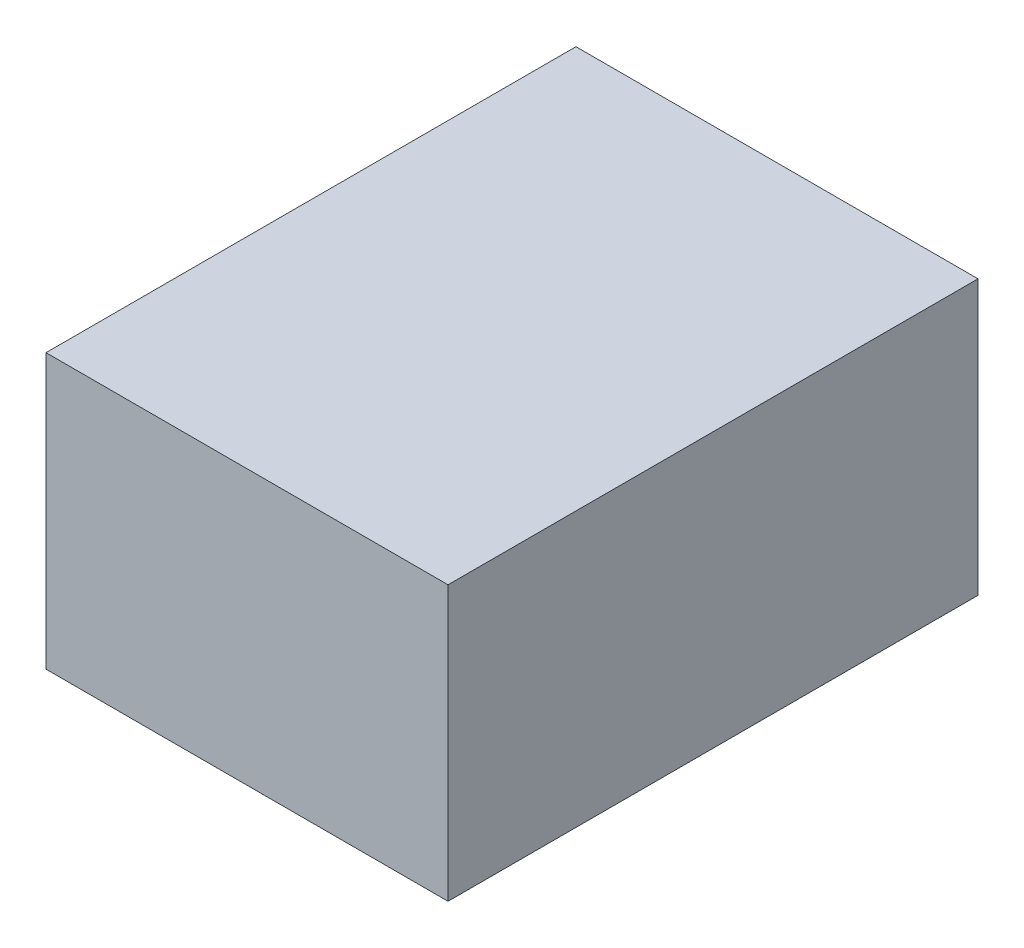
ISO-10303-21;
HEADER;
FILE_DESCRIPTION(('STEP AP214'),'2;1');
FILE_NAME('part.step','',(''),(''),'','','');
FILE_SCHEMA(('AUTOMOTIVE_DESIGN { 1 0 10303 214 1 1 1 1 }'));
ENDSEC;
DATA;
#1=APPLICATION_CONTEXT('core data for automotive mechanical design processes');
#2=APPLICATION_PROTOCOL_DEFINITION('international standard','automotive_design',2000,#1);
#3=PRODUCT_CONTEXT('',#1,'mechanical');
#4=PRODUCT('Part','Part','',(#3));
#5=PRODUCT_RELATED_PRODUCT_CATEGORY('part','',(#4));
#6=PRODUCT_DEFINITION_FORMATION('','',#4);
#7=PRODUCT_DEFINITION_CONTEXT('part definition',#1,'design');
#8=PRODUCT_DEFINITION('design','',#6,#7);
#9=PRODUCT_DEFINITION_SHAPE('','',#8);
#10=(LENGTH_UNIT() NAMED_UNIT(*) SI_UNIT(.MILLI.,.METRE.));
#11=(NAMED_UNIT(*) PLANE_ANGLE_UNIT() SI_UNIT($,.RADIAN.));
#12=(NAMED_UNIT(*) SI_UNIT($,.STERADIAN.) SOLID_ANGLE_UNIT());
#13=UNCERTAINTY_MEASURE_WITH_UNIT(LENGTH_MEASURE(1.E-05),#10,'distance_accuracy_value','');
#14=(GEOMETRIC_REPRESENTATION_CONTEXT(3) GLOBAL_UNCERTAINTY_ASSIGNED_CONTEXT((#13)) GLOBAL_UNIT_ASSIGNED_CONTEXT((#10,
#11,#12)) REPRESENTATION_CONTEXT('',''));
#15=CARTESIAN_POINT('',(0.,0.,0.));
#16=DIRECTION('',(0.,0.,1.));
#17=DIRECTION('',(1.,0.,0.));
#18=AXIS2_PLACEMENT_3D('',#15,#16,#17);
#19=CARTESIAN_POINT('',(-11.,15.,14.5));
#20=DIRECTION('',(1.,0.,0.));
#21=DIRECTION('',(0.,0.,-1.));
#22=AXIS2_PLACEMENT_3D('',#19,#20,#21);
#23=PLANE('',#22);
#24=DIRECTION('',(0.,0.,1.));
#25=VECTOR('',#24,1.);
#26=CARTESIAN_POINT('',(-11.,0.,14.5));
#27=LINE('',#26,#25);
#28=CARTESIAN_POINT('',(-11.,0.,-14.5));
#29=VERTEX_POINT('',#28);
#30=CARTESIAN_POINT('',(-11.,0.,14.5));
#31=VERTEX_POINT('',#30);
#32=EDGE_CURVE('E107',#29,#31,#27,.T.);
#33=ORIENTED_EDGE('',*,*,#32,.T.);
#34=DIRECTION('',(0.,-1.,0.));
#35=VECTOR('',#34,1.);
#36=CARTESIAN_POINT('',(-11.,15.,14.5));
#37=LINE('',#36,#35);
#38=CARTESIAN_POINT('',(-11.,15.,14.5));
#39=VERTEX_POINT('',#38);
#40=EDGE_CURVE('E11',#39,#31,#37,.T.);
#41=ORIENTED_EDGE('',*,*,#40,.F.);
#42=DIRECTION('',(0.,0.,1.));
#43=VECTOR('',#42,1.);
#44=CARTESIAN_POINT('',(-11.,15.,14.5));
#45=LINE('',#44,#43);
#46=CARTESIAN_POINT('',(-11.,15.,-14.5));
#47=VERTEX_POINT('',#46);
#48=EDGE_CURVE('E91',#47,#39,#45,.T.);
#49=ORIENTED_EDGE('',*,*,#48,.F.);
#50=DIRECTION('',(0.,-1.,0.));
#51=VECTOR('',#50,1.);
#52=CARTESIAN_POINT('',(-11.,15.,-14.5));
#53=LINE('',#52,#51);
#54=EDGE_CURVE('E103',#47,#29,#53,.T.);
#55=ORIENTED_EDGE('',*,*,#54,.T.);
#56=EDGE_LOOP('',(#33,#41,#49,#55));
#57=FACE_BOUND('',#56,.T.);
#58=ADVANCED_FACE('F39',(#57),#23,.F.);
#59=CARTESIAN_POINT('',(11.,15.,14.5));
#60=DIRECTION('',(0.,0.,-1.));
#61=DIRECTION('',(-1.,0.,0.));
#62=AXIS2_PLACEMENT_3D('',#59,#60,#61);
#63=PLANE('',#62);
#64=DIRECTION('',(1.,0.,0.));
#65=VECTOR('',#64,1.);
#66=CARTESIAN_POINT('',(11.,0.,14.5));
#67=LINE('',#66,#65);
#68=CARTESIAN_POINT('',(11.,0.,14.5));
#69=VERTEX_POINT('',#68);
#70=EDGE_CURVE('E96',#31,#69,#67,.T.);
#71=ORIENTED_EDGE('',*,*,#70,.T.);
#72=DIRECTION('',(0.,-1.,0.));
#73=VECTOR('',#72,1.);
#74=CARTESIAN_POINT('',(11.,15.,14.5));
#75=LINE('',#74,#73);
#76=CARTESIAN_POINT('',(11.,15.,14.5));
#77=VERTEX_POINT('',#76);
#78=EDGE_CURVE('E48',#77,#69,#75,.T.);
#79=ORIENTED_EDGE('',*,*,#78,.F.);
#80=DIRECTION('',(1.,0.,0.));
#81=VECTOR('',#80,1.);
#82=CARTESIAN_POINT('',(11.,15.,14.5));
#83=LINE('',#82,#81);
#84=EDGE_CURVE('E86',#39,#77,#83,.T.);
#85=ORIENTED_EDGE('',*,*,#84,.F.);
#86=ORIENTED_EDGE('',*,*,#40,.T.);
#87=EDGE_LOOP('',(#71,#79,#85,#86));
#88=FACE_BOUND('',#87,.T.);
#89=ADVANCED_FACE('F95',(#88),#63,.F.);
#90=CARTESIAN_POINT('',(11.,15.,14.5));
#91=DIRECTION('',(-1.,0.,0.));
#92=DIRECTION('',(0.,0.,1.));
#93=AXIS2_PLACEMENT_3D('',#90,#91,#92);
#94=PLANE('',#93);
#95=DIRECTION('',(0.,0.,-1.));
#96=VECTOR('',#95,1.);
#97=CARTESIAN_POINT('',(11.,0.,14.5));
#98=LINE('',#97,#96);
#99=CARTESIAN_POINT('',(11.,0.,-14.5));
#100=VERTEX_POINT('',#99);
#101=EDGE_CURVE('E73',#69,#100,#98,.T.);
#102=ORIENTED_EDGE('',*,*,#101,.T.);
#103=DIRECTION('',(0.,-1.,0.));
#104=VECTOR('',#103,1.);
#105=CARTESIAN_POINT('',(11.,15.,-14.5));
#106=LINE('',#105,#104);
#107=CARTESIAN_POINT('',(11.,15.,-14.5));
#108=VERTEX_POINT('',#107);
#109=EDGE_CURVE('E98',#108,#100,#106,.T.);
#110=ORIENTED_EDGE('',*,*,#109,.F.);
#111=DIRECTION('',(0.,0.,-1.));
#112=VECTOR('',#111,1.);
#113=CARTESIAN_POINT('',(11.,15.,14.5));
#114=LINE('',#113,#112);
#115=EDGE_CURVE('E89',#77,#108,#114,.T.);
#116=ORIENTED_EDGE('',*,*,#115,.F.);
#117=ORIENTED_EDGE('',*,*,#78,.T.);
#118=EDGE_LOOP('',(#102,#110,#116,#117));
#119=FACE_BOUND('',#118,.T.);
#120=ADVANCED_FACE('F99',(#119),#94,.F.);
#121=CARTESIAN_POINT('',(11.,15.,-14.5));
#122=DIRECTION('',(0.,0.,1.));
#123=DIRECTION('',(1.,0.,0.));
#124=AXIS2_PLACEMENT_3D('',#121,#122,#123);
#125=PLANE('',#124);
#126=DIRECTION('',(-1.,0.,0.));
#127=VECTOR('',#126,1.);
#128=CARTESIAN_POINT('',(11.,0.,-14.5));
#129=LINE('',#128,#127);
#130=EDGE_CURVE('E79',#100,#29,#129,.T.);
#131=ORIENTED_EDGE('',*,*,#130,.T.);
#132=ORIENTED_EDGE('',*,*,#54,.F.);
#133=DIRECTION('',(-1.,0.,0.));
#134=VECTOR('',#133,1.);
#135=CARTESIAN_POINT('',(11.,15.,-14.5));
#136=LINE('',#135,#134);
#137=EDGE_CURVE('E56',#108,#47,#136,.T.);
#138=ORIENTED_EDGE('',*,*,#137,.F.);
#139=ORIENTED_EDGE('',*,*,#109,.T.);
#140=EDGE_LOOP('',(#131,#132,#138,#139));
#141=FACE_BOUND('',#140,.T.);
#142=ADVANCED_FACE('F120',(#141),#125,.F.);
#143=CARTESIAN_POINT('',(0.,15.,0.));
#144=DIRECTION('',(0.,1.,0.));
#145=DIRECTION('',(0.,0.,1.));
#146=AXIS2_PLACEMENT_3D('',#143,#144,#145);
#147=PLANE('',#146);
#148=ORIENTED_EDGE('',*,*,#48,.T.);
#149=ORIENTED_EDGE('',*,*,#84,.T.);
#150=ORIENTED_EDGE('',*,*,#115,.T.);
#151=ORIENTED_EDGE('',*,*,#137,.T.);
#152=EDGE_LOOP('',(#148,#149,#150,#151));
#153=FACE_BOUND('',#152,.T.);
#154=ADVANCED_FACE('F87',(#153),#147,.T.);
#155=CARTESIAN_POINT('',(0.,0.,0.));
#156=DIRECTION('',(0.,1.,0.));
#157=DIRECTION('',(0.,0.,1.));
#158=AXIS2_PLACEMENT_3D('',#155,#156,#157);
#159=PLANE('',#158);
#160=ORIENTED_EDGE('',*,*,#32,.F.);
#161=ORIENTED_EDGE('',*,*,#130,.F.);
#162=ORIENTED_EDGE('',*,*,#101,.F.);
#163=ORIENTED_EDGE('',*,*,#70,.F.);
#164=EDGE_LOOP('',(#160,#161,#162,#163));
#165=FACE_BOUND('',#164,.T.);
#166=ADVANCED_FACE('F123',(#165),#159,.F.);
#167=CLOSED_SHELL('',(#58,#89,#120,#142,#154,#166));
#168=MANIFOLD_SOLID_BREP('B2',#167);
#169=ADVANCED_BREP_SHAPE_REPRESENTATION('',(#18,#168),#14);
#170=SHAPE_DEFINITION_REPRESENTATION(#9,#169);
ENDSEC;
END-ISO-10303-21;
